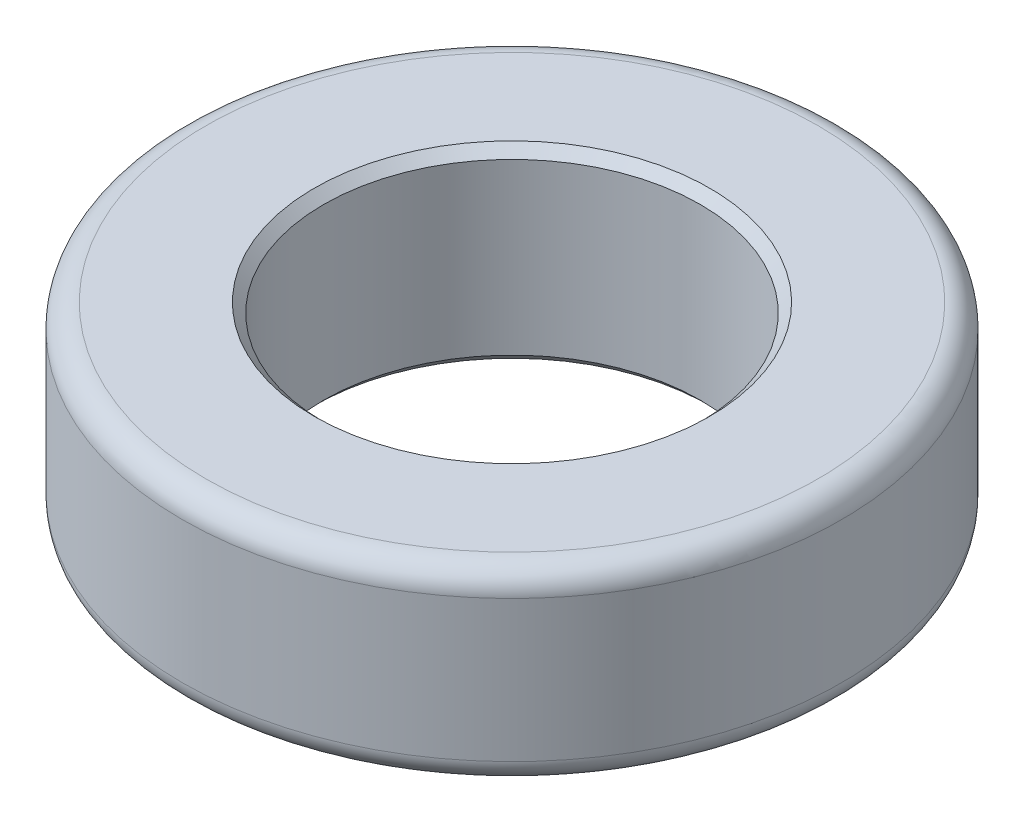
ISO-10303-21;
HEADER;
FILE_DESCRIPTION(('STEP AP214'),'2;1');
FILE_NAME('part.step','',(''),(''),'','','');
FILE_SCHEMA(('AUTOMOTIVE_DESIGN { 1 0 10303 214 1 1 1 1 }'));
ENDSEC;
DATA;
#1=APPLICATION_CONTEXT('core data for automotive mechanical design processes');
#2=APPLICATION_PROTOCOL_DEFINITION('international standard','automotive_design',2000,#1);
#3=PRODUCT_CONTEXT('',#1,'mechanical');
#4=PRODUCT('Part','Part','',(#3));
#5=PRODUCT_RELATED_PRODUCT_CATEGORY('part','',(#4));
#6=PRODUCT_DEFINITION_FORMATION('','',#4);
#7=PRODUCT_DEFINITION_CONTEXT('part definition',#1,'design');
#8=PRODUCT_DEFINITION('design','',#6,#7);
#9=PRODUCT_DEFINITION_SHAPE('','',#8);
#10=(LENGTH_UNIT() NAMED_UNIT(*) SI_UNIT(.MILLI.,.METRE.));
#11=(NAMED_UNIT(*) PLANE_ANGLE_UNIT() SI_UNIT($,.RADIAN.));
#12=(NAMED_UNIT(*) SI_UNIT($,.STERADIAN.) SOLID_ANGLE_UNIT());
#13=UNCERTAINTY_MEASURE_WITH_UNIT(LENGTH_MEASURE(1.E-05),#10,'distance_accuracy_value','');
#14=(GEOMETRIC_REPRESENTATION_CONTEXT(3) GLOBAL_UNCERTAINTY_ASSIGNED_CONTEXT((#13)) GLOBAL_UNIT_ASSIGNED_CONTEXT((#10,
#11,#12)) REPRESENTATION_CONTEXT('',''));
#15=CARTESIAN_POINT('',(0.,0.,0.));
#16=DIRECTION('',(0.,0.,1.));
#17=DIRECTION('',(1.,0.,0.));
#18=AXIS2_PLACEMENT_3D('',#15,#16,#17);
#19=CARTESIAN_POINT('',(0.,4.,0.));
#20=DIRECTION('',(0.,1.,0.));
#21=DIRECTION('',(0.,0.,1.));
#22=AXIS2_PLACEMENT_3D('',#19,#20,#21);
#23=PLANE('',#22);
#24=CARTESIAN_POINT('',(0.,4.,0.));
#25=DIRECTION('',(0.,1.,0.));
#26=DIRECTION('',(0.,0.,1.));
#27=AXIS2_PLACEMENT_3D('',#24,#25,#26);
#28=CIRCLE('',#27,6.5);
#29=CARTESIAN_POINT('',(0.,4.,6.5));
#30=VERTEX_POINT('',#29);
#31=EDGE_CURVE('E10',#30,#30,#28,.T.);
#32=ORIENTED_EDGE('',*,*,#31,.T.);
#33=EDGE_LOOP('',(#32));
#34=FACE_BOUND('',#33,.T.);
#35=CARTESIAN_POINT('',(0.,4.,0.));
#36=DIRECTION('',(0.,1.,0.));
#37=DIRECTION('',(0.,0.,1.));
#38=AXIS2_PLACEMENT_3D('',#35,#36,#37);
#39=CIRCLE('',#38,4.2);
#40=CARTESIAN_POINT('',(0.,4.,4.2));
#41=VERTEX_POINT('',#40);
#42=EDGE_CURVE('E55',#41,#41,#39,.F.);
#43=ORIENTED_EDGE('',*,*,#42,.T.);
#44=EDGE_LOOP('',(#43));
#45=FACE_BOUND('',#44,.T.);
#46=ADVANCED_FACE('F35',(#34,#45),#23,.T.);
#47=CARTESIAN_POINT('',(0.,0.,0.));
#48=DIRECTION('',(0.,1.,0.));
#49=DIRECTION('',(0.,0.,1.));
#50=AXIS2_PLACEMENT_3D('',#47,#48,#49);
#51=PLANE('',#50);
#52=CARTESIAN_POINT('',(0.,0.,0.));
#53=DIRECTION('',(0.,1.,0.));
#54=DIRECTION('',(0.,0.,1.));
#55=AXIS2_PLACEMENT_3D('',#52,#53,#54);
#56=CIRCLE('',#55,6.5);
#57=CARTESIAN_POINT('',(0.,0.,6.5));
#58=VERTEX_POINT('',#57);
#59=EDGE_CURVE('E42',#58,#58,#56,.F.);
#60=ORIENTED_EDGE('',*,*,#59,.T.);
#61=EDGE_LOOP('',(#60));
#62=FACE_BOUND('',#61,.T.);
#63=CARTESIAN_POINT('',(0.,0.,0.));
#64=DIRECTION('',(0.,1.,0.));
#65=DIRECTION('',(0.,0.,1.));
#66=AXIS2_PLACEMENT_3D('',#63,#64,#65);
#67=CIRCLE('',#66,4.2);
#68=CARTESIAN_POINT('',(0.,0.,4.2));
#69=VERTEX_POINT('',#68);
#70=EDGE_CURVE('E64',#69,#69,#67,.T.);
#71=ORIENTED_EDGE('',*,*,#70,.T.);
#72=EDGE_LOOP('',(#71));
#73=FACE_BOUND('',#72,.T.);
#74=ADVANCED_FACE('F68',(#62,#73),#51,.F.);
#75=CARTESIAN_POINT('',(0.,4.,0.));
#76=DIRECTION('',(0.,-1.,0.));
#77=DIRECTION('',(0.,0.,-1.));
#78=AXIS2_PLACEMENT_3D('',#75,#76,#77);
#79=CYLINDRICAL_SURFACE('',#78,7.);
#80=CARTESIAN_POINT('',(0.,0.5,0.));
#81=DIRECTION('',(0.,1.,0.));
#82=DIRECTION('',(0.,0.,1.));
#83=AXIS2_PLACEMENT_3D('',#80,#81,#82);
#84=CIRCLE('',#83,7.);
#85=CARTESIAN_POINT('',(0.,0.5,7.));
#86=VERTEX_POINT('',#85);
#87=EDGE_CURVE('E46',#86,#86,#84,.T.);
#88=ORIENTED_EDGE('',*,*,#87,.T.);
#89=EDGE_LOOP('',(#88));
#90=FACE_BOUND('',#89,.T.);
#91=CARTESIAN_POINT('',(0.,3.5,0.));
#92=DIRECTION('',(0.,1.,0.));
#93=DIRECTION('',(0.,0.,1.));
#94=AXIS2_PLACEMENT_3D('',#91,#92,#93);
#95=CIRCLE('',#94,7.);
#96=CARTESIAN_POINT('',(0.,3.5,7.));
#97=VERTEX_POINT('',#96);
#98=EDGE_CURVE('E50',#97,#97,#95,.F.);
#99=ORIENTED_EDGE('',*,*,#98,.T.);
#100=EDGE_LOOP('',(#99));
#101=FACE_BOUND('',#100,.T.);
#102=ADVANCED_FACE('F83',(#90,#101),#79,.T.);
#103=CARTESIAN_POINT('',(0.,4.,0.));
#104=DIRECTION('',(0.,-1.,0.));
#105=DIRECTION('',(0.,0.,-1.));
#106=AXIS2_PLACEMENT_3D('',#103,#104,#105);
#107=CYLINDRICAL_SURFACE('',#106,4.);
#108=CARTESIAN_POINT('',(0.,0.200000000000001,0.));
#109=DIRECTION('',(0.,1.,0.));
#110=DIRECTION('',(0.,0.,1.));
#111=AXIS2_PLACEMENT_3D('',#108,#109,#110);
#112=CIRCLE('',#111,4.);
#113=CARTESIAN_POINT('',(0.,0.200000000000001,4.));
#114=VERTEX_POINT('',#113);
#115=EDGE_CURVE('E58',#114,#114,#112,.F.);
#116=ORIENTED_EDGE('',*,*,#115,.T.);
#117=EDGE_LOOP('',(#116));
#118=FACE_BOUND('',#117,.T.);
#119=CARTESIAN_POINT('',(0.,3.8,0.));
#120=DIRECTION('',(0.,1.,0.));
#121=DIRECTION('',(0.,0.,1.));
#122=AXIS2_PLACEMENT_3D('',#119,#120,#121);
#123=CIRCLE('',#122,4.);
#124=CARTESIAN_POINT('',(0.,3.8,4.));
#125=VERTEX_POINT('',#124);
#126=EDGE_CURVE('E61',#125,#125,#123,.T.);
#127=ORIENTED_EDGE('',*,*,#126,.T.);
#128=EDGE_LOOP('',(#127));
#129=FACE_BOUND('',#128,.T.);
#130=ADVANCED_FACE('F73',(#118,#129),#107,.F.);
#131=CARTESIAN_POINT('',(0.,0.,0.));
#132=DIRECTION('',(0.,-1.,0.));
#133=DIRECTION('',(0.,0.,-1.));
#134=AXIS2_PLACEMENT_3D('',#131,#132,#133);
#135=CONICAL_SURFACE('',#134,4.2,0.785398163397446);
#136=ORIENTED_EDGE('',*,*,#115,.F.);
#137=EDGE_LOOP('',(#136));
#138=FACE_BOUND('',#137,.T.);
#139=ORIENTED_EDGE('',*,*,#70,.F.);
#140=EDGE_LOOP('',(#139));
#141=FACE_BOUND('',#140,.T.);
#142=ADVANCED_FACE('F70',(#138,#141),#135,.F.);
#143=CARTESIAN_POINT('',(0.,3.8,0.));
#144=DIRECTION('',(0.,1.,0.));
#145=DIRECTION('',(0.,0.,1.));
#146=AXIS2_PLACEMENT_3D('',#143,#144,#145);
#147=CONICAL_SURFACE('',#146,4.,0.785398163397455);
#148=ORIENTED_EDGE('',*,*,#42,.F.);
#149=EDGE_LOOP('',(#148));
#150=FACE_BOUND('',#149,.T.);
#151=ORIENTED_EDGE('',*,*,#126,.F.);
#152=EDGE_LOOP('',(#151));
#153=FACE_BOUND('',#152,.T.);
#154=ADVANCED_FACE('F72',(#150,#153),#147,.F.);
#155=CARTESIAN_POINT('',(0.,0.5,0.));
#156=DIRECTION('',(0.,1.,0.));
#157=DIRECTION('',(0.,0.,1.));
#158=AXIS2_PLACEMENT_3D('',#155,#156,#157);
#159=TOROIDAL_SURFACE('',#158,6.5,0.5);
#160=ORIENTED_EDGE('',*,*,#59,.F.);
#161=EDGE_LOOP('',(#160));
#162=FACE_BOUND('',#161,.T.);
#163=ORIENTED_EDGE('',*,*,#87,.F.);
#164=EDGE_LOOP('',(#163));
#165=FACE_BOUND('',#164,.T.);
#166=ADVANCED_FACE('F80',(#162,#165),#159,.T.);
#167=CARTESIAN_POINT('',(0.,3.5,0.));
#168=DIRECTION('',(0.,1.,0.));
#169=DIRECTION('',(0.,0.,1.));
#170=AXIS2_PLACEMENT_3D('',#167,#168,#169);
#171=TOROIDAL_SURFACE('',#170,6.5,0.5);
#172=ORIENTED_EDGE('',*,*,#98,.F.);
#173=EDGE_LOOP('',(#172));
#174=FACE_BOUND('',#173,.T.);
#175=ORIENTED_EDGE('',*,*,#31,.F.);
#176=EDGE_LOOP('',(#175));
#177=FACE_BOUND('',#176,.T.);
#178=ADVANCED_FACE('F37',(#174,#177),#171,.T.);
#179=CLOSED_SHELL('',(#46,#74,#102,#130,#142,#154,#166,#178));
#180=MANIFOLD_SOLID_BREP('B2',#179);
#181=ADVANCED_BREP_SHAPE_REPRESENTATION('',(#18,#180),#14);
#182=SHAPE_DEFINITION_REPRESENTATION(#9,#181);
ENDSEC;
END-ISO-10303-21;
